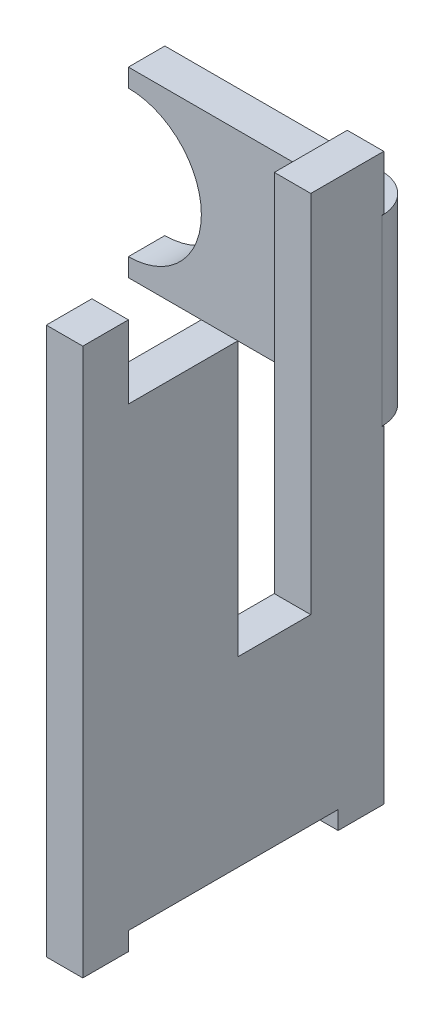
ISO-10303-21;
HEADER;
FILE_DESCRIPTION(('STEP AP214'),'2;1');
FILE_NAME('part.step','',(''),(''),'','','');
FILE_SCHEMA(('AUTOMOTIVE_DESIGN { 1 0 10303 214 1 1 1 1 }'));
ENDSEC;
DATA;
#1=APPLICATION_CONTEXT('core data for automotive mechanical design processes');
#2=APPLICATION_PROTOCOL_DEFINITION('international standard','automotive_design',2000,#1);
#3=PRODUCT_CONTEXT('',#1,'mechanical');
#4=PRODUCT('Part','Part','',(#3));
#5=PRODUCT_RELATED_PRODUCT_CATEGORY('part','',(#4));
#6=PRODUCT_DEFINITION_FORMATION('','',#4);
#7=PRODUCT_DEFINITION_CONTEXT('part definition',#1,'design');
#8=PRODUCT_DEFINITION('design','',#6,#7);
#9=PRODUCT_DEFINITION_SHAPE('','',#8);
#10=(LENGTH_UNIT() NAMED_UNIT(*) SI_UNIT(.MILLI.,.METRE.));
#11=(NAMED_UNIT(*) PLANE_ANGLE_UNIT() SI_UNIT($,.RADIAN.));
#12=(NAMED_UNIT(*) SI_UNIT($,.STERADIAN.) SOLID_ANGLE_UNIT());
#13=UNCERTAINTY_MEASURE_WITH_UNIT(LENGTH_MEASURE(1.E-05),#10,'distance_accuracy_value','');
#14=(GEOMETRIC_REPRESENTATION_CONTEXT(3) GLOBAL_UNCERTAINTY_ASSIGNED_CONTEXT((#13)) GLOBAL_UNIT_ASSIGNED_CONTEXT((#10,
#11,#12)) REPRESENTATION_CONTEXT('',''));
#15=CARTESIAN_POINT('',(0.,0.,0.));
#16=DIRECTION('',(0.,0.,1.));
#17=DIRECTION('',(1.,0.,0.));
#18=AXIS2_PLACEMENT_3D('',#15,#16,#17);
#19=CARTESIAN_POINT('',(-1.4,0.25,-1.025));
#20=DIRECTION('',(1.,0.,0.));
#21=DIRECTION('',(0.,0.,-1.));
#22=AXIS2_PLACEMENT_3D('',#19,#20,#21);
#23=PLANE('',#22);
#24=DIRECTION('',(0.,1.,0.));
#25=VECTOR('',#24,1.);
#26=CARTESIAN_POINT('',(-1.4,0.,-0.825));
#27=LINE('',#26,#25);
#28=CARTESIAN_POINT('',(-1.4,1.15,-0.825));
#29=VERTEX_POINT('',#28);
#30=CARTESIAN_POINT('',(-1.4,1.25,-0.825));
#31=VERTEX_POINT('',#30);
#32=EDGE_CURVE('E252',#29,#31,#27,.T.);
#33=ORIENTED_EDGE('',*,*,#32,.T.);
#34=DIRECTION('',(0.,0.,-1.));
#35=VECTOR('',#34,1.);
#36=CARTESIAN_POINT('',(-1.4,1.25,-1.025));
#37=LINE('',#36,#35);
#38=CARTESIAN_POINT('',(-1.4,1.25,-1.025));
#39=VERTEX_POINT('',#38);
#40=EDGE_CURVE('E204',#31,#39,#37,.T.);
#41=ORIENTED_EDGE('',*,*,#40,.T.);
#42=DIRECTION('',(0.,1.,0.));
#43=VECTOR('',#42,1.);
#44=CARTESIAN_POINT('',(-1.4,0.,-1.025));
#45=LINE('',#44,#43);
#46=CARTESIAN_POINT('',(-1.4,1.15,-1.025));
#47=VERTEX_POINT('',#46);
#48=EDGE_CURVE('E202',#47,#39,#45,.T.);
#49=ORIENTED_EDGE('',*,*,#48,.F.);
#50=DIRECTION('',(0.,0.,-1.));
#51=VECTOR('',#50,1.);
#52=CARTESIAN_POINT('',(-1.4,1.15,-4.69701497931));
#53=LINE('',#52,#51);
#54=EDGE_CURVE('E191',#47,#29,#53,.F.);
#55=ORIENTED_EDGE('',*,*,#54,.T.);
#56=EDGE_LOOP('',(#33,#41,#49,#55));
#57=FACE_BOUND('',#56,.T.);
#58=ADVANCED_FACE('F17',(#57),#23,.F.);
#59=CARTESIAN_POINT('',(-1.4,0.75,-4.69701497931));
#60=DIRECTION('',(0.,0.,-1.));
#61=DIRECTION('',(-1.,0.,0.));
#62=AXIS2_PLACEMENT_3D('',#59,#60,#61);
#63=CYLINDRICAL_SURFACE('',#62,0.4);
#64=ORIENTED_EDGE('',*,*,#54,.F.);
#65=CARTESIAN_POINT('',(-1.4,0.75,-1.025));
#66=DIRECTION('',(0.,0.,-1.));
#67=DIRECTION('',(-1.,0.,0.));
#68=AXIS2_PLACEMENT_3D('',#65,#66,#67);
#69=CIRCLE('',#68,0.4);
#70=CARTESIAN_POINT('',(-1.4,0.35,-1.025));
#71=VERTEX_POINT('',#70);
#72=EDGE_CURVE('E20',#71,#47,#69,.F.);
#73=ORIENTED_EDGE('',*,*,#72,.F.);
#74=DIRECTION('',(0.,0.,-1.));
#75=VECTOR('',#74,1.);
#76=CARTESIAN_POINT('',(-1.4,0.35,-1.025));
#77=LINE('',#76,#75);
#78=CARTESIAN_POINT('',(-1.4,0.35,-0.825));
#79=VERTEX_POINT('',#78);
#80=EDGE_CURVE('E186',#71,#79,#77,.F.);
#81=ORIENTED_EDGE('',*,*,#80,.T.);
#82=CARTESIAN_POINT('',(-1.4,0.75,-0.825));
#83=DIRECTION('',(0.,0.,-1.));
#84=DIRECTION('',(-1.,0.,0.));
#85=AXIS2_PLACEMENT_3D('',#82,#83,#84);
#86=CIRCLE('',#85,0.4);
#87=EDGE_CURVE('E197',#79,#29,#86,.F.);
#88=ORIENTED_EDGE('',*,*,#87,.T.);
#89=EDGE_LOOP('',(#64,#73,#81,#88));
#90=FACE_BOUND('',#89,.T.);
#91=ADVANCED_FACE('F193',(#90),#63,.F.);
#92=CARTESIAN_POINT('',(-1.4,0.25,-1.025));
#93=DIRECTION('',(1.,0.,0.));
#94=DIRECTION('',(0.,0.,-1.));
#95=AXIS2_PLACEMENT_3D('',#92,#93,#94);
#96=PLANE('',#95);
#97=DIRECTION('',(0.,1.,0.));
#98=VECTOR('',#97,1.);
#99=CARTESIAN_POINT('',(-1.4,0.,-1.025));
#100=LINE('',#99,#98);
#101=CARTESIAN_POINT('',(-1.4,0.25,-1.025));
#102=VERTEX_POINT('',#101);
#103=EDGE_CURVE('E211',#102,#71,#100,.T.);
#104=ORIENTED_EDGE('',*,*,#103,.F.);
#105=DIRECTION('',(0.,0.,1.));
#106=VECTOR('',#105,1.);
#107=CARTESIAN_POINT('',(-1.4,0.25,-1.025));
#108=LINE('',#107,#106);
#109=CARTESIAN_POINT('',(-1.4,0.25,-0.825));
#110=VERTEX_POINT('',#109);
#111=EDGE_CURVE('E219',#102,#110,#108,.T.);
#112=ORIENTED_EDGE('',*,*,#111,.T.);
#113=DIRECTION('',(0.,1.,0.));
#114=VECTOR('',#113,1.);
#115=CARTESIAN_POINT('',(-1.4,0.,-0.825));
#116=LINE('',#115,#114);
#117=EDGE_CURVE('E250',#110,#79,#116,.T.);
#118=ORIENTED_EDGE('',*,*,#117,.T.);
#119=ORIENTED_EDGE('',*,*,#80,.F.);
#120=EDGE_LOOP('',(#104,#112,#118,#119));
#121=FACE_BOUND('',#120,.T.);
#122=ADVANCED_FACE('F465',(#121),#96,.F.);
#123=CARTESIAN_POINT('',(0.,0.,-1.025));
#124=DIRECTION('',(0.,0.,-1.));
#125=DIRECTION('',(-1.,0.,0.));
#126=AXIS2_PLACEMENT_3D('',#123,#124,#125);
#127=PLANE('',#126);
#128=DIRECTION('',(0.,-1.,0.));
#129=VECTOR('',#128,1.);
#130=CARTESIAN_POINT('',(-0.21,0.25,-1.025));
#131=LINE('',#130,#129);
#132=CARTESIAN_POINT('',(-0.21,0.25,-1.025));
#133=VERTEX_POINT('',#132);
#134=CARTESIAN_POINT('',(-0.21,1.25,-1.025));
#135=VERTEX_POINT('',#134);
#136=EDGE_CURVE('E207',#133,#135,#131,.F.);
#137=ORIENTED_EDGE('',*,*,#136,.F.);
#138=DIRECTION('',(1.,0.,0.));
#139=VECTOR('',#138,1.);
#140=CARTESIAN_POINT('',(-0.150309739582,0.25,-1.025));
#141=LINE('',#140,#139);
#142=EDGE_CURVE('E249',#133,#102,#141,.F.);
#143=ORIENTED_EDGE('',*,*,#142,.T.);
#144=ORIENTED_EDGE('',*,*,#103,.T.);
#145=ORIENTED_EDGE('',*,*,#72,.T.);
#146=ORIENTED_EDGE('',*,*,#48,.T.);
#147=DIRECTION('',(1.,0.,0.));
#148=VECTOR('',#147,1.);
#149=CARTESIAN_POINT('',(-0.150309739582,1.25,-1.025));
#150=LINE('',#149,#148);
#151=EDGE_CURVE('E227',#39,#135,#150,.T.);
#152=ORIENTED_EDGE('',*,*,#151,.T.);
#153=EDGE_LOOP('',(#137,#143,#144,#145,#146,#152));
#154=FACE_BOUND('',#153,.T.);
#155=ADVANCED_FACE('F209',(#154),#127,.T.);
#156=CARTESIAN_POINT('',(-0.21,0.25,-0.815));
#157=DIRECTION('',(0.,-1.,0.));
#158=DIRECTION('',(0.,0.,-1.));
#159=AXIS2_PLACEMENT_3D('',#156,#157,#158);
#160=CYLINDRICAL_SURFACE('',#159,0.21);
#161=CARTESIAN_POINT('',(-0.21,0.25,-0.815));
#162=DIRECTION('',(0.,-1.,0.));
#163=DIRECTION('',(0.,0.,-1.));
#164=AXIS2_PLACEMENT_3D('',#161,#162,#163);
#165=CIRCLE('',#164,0.21);
#166=CARTESIAN_POINT('',(0.,0.25,-0.815));
#167=VERTEX_POINT('',#166);
#168=EDGE_CURVE('E246',#167,#133,#165,.F.);
#169=ORIENTED_EDGE('',*,*,#168,.T.);
#170=ORIENTED_EDGE('',*,*,#136,.T.);
#171=CARTESIAN_POINT('',(-0.21,1.25,-0.815));
#172=DIRECTION('',(0.,-1.,0.));
#173=DIRECTION('',(0.,0.,-1.));
#174=AXIS2_PLACEMENT_3D('',#171,#172,#173);
#175=CIRCLE('',#174,0.21);
#176=CARTESIAN_POINT('',(0.,1.25,-0.815));
#177=VERTEX_POINT('',#176);
#178=EDGE_CURVE('E251',#135,#177,#175,.T.);
#179=ORIENTED_EDGE('',*,*,#178,.T.);
#180=DIRECTION('',(0.,1.,0.));
#181=VECTOR('',#180,1.);
#182=CARTESIAN_POINT('',(0.,0.,-0.815));
#183=LINE('',#182,#181);
#184=EDGE_CURVE('E284',#177,#167,#183,.F.);
#185=ORIENTED_EDGE('',*,*,#184,.T.);
#186=EDGE_LOOP('',(#169,#170,#179,#185));
#187=FACE_BOUND('',#186,.T.);
#188=ADVANCED_FACE('F557',(#187),#160,.T.);
#189=CARTESIAN_POINT('',(-0.150309739582,1.25,-1.025));
#190=DIRECTION('',(0.,-1.,0.));
#191=DIRECTION('',(0.,0.,-1.));
#192=AXIS2_PLACEMENT_3D('',#189,#190,#191);
#193=PLANE('',#192);
#194=CARTESIAN_POINT('',(-0.21,1.25,-0.815));
#195=DIRECTION('',(0.,-1.,0.));
#196=DIRECTION('',(0.,0.,-1.));
#197=AXIS2_PLACEMENT_3D('',#194,#195,#196);
#198=CIRCLE('',#197,0.01);
#199=CARTESIAN_POINT('',(-0.21,1.25,-0.825));
#200=VERTEX_POINT('',#199);
#201=CARTESIAN_POINT('',(-0.2,1.25,-0.815));
#202=VERTEX_POINT('',#201);
#203=EDGE_CURVE('E243',#200,#202,#198,.T.);
#204=ORIENTED_EDGE('',*,*,#203,.T.);
#205=DIRECTION('',(1.,0.,0.));
#206=VECTOR('',#205,1.);
#207=CARTESIAN_POINT('',(0.,1.25,-0.815));
#208=LINE('',#207,#206);
#209=EDGE_CURVE('E245',#202,#177,#208,.T.);
#210=ORIENTED_EDGE('',*,*,#209,.T.);
#211=ORIENTED_EDGE('',*,*,#178,.F.);
#212=ORIENTED_EDGE('',*,*,#151,.F.);
#213=ORIENTED_EDGE('',*,*,#40,.F.);
#214=DIRECTION('',(-1.,0.,0.));
#215=VECTOR('',#214,1.);
#216=CARTESIAN_POINT('',(0.,1.25,-0.825));
#217=LINE('',#216,#215);
#218=EDGE_CURVE('E256',#31,#200,#217,.F.);
#219=ORIENTED_EDGE('',*,*,#218,.T.);
#220=EDGE_LOOP('',(#204,#210,#211,#212,#213,#219));
#221=FACE_BOUND('',#220,.T.);
#222=ADVANCED_FACE('F473',(#221),#193,.F.);
#223=CARTESIAN_POINT('',(0.,0.,-0.825));
#224=DIRECTION('',(0.,0.,-1.));
#225=DIRECTION('',(-1.,0.,0.));
#226=AXIS2_PLACEMENT_3D('',#223,#224,#225);
#227=PLANE('',#226);
#228=ORIENTED_EDGE('',*,*,#117,.F.);
#229=DIRECTION('',(1.,0.,0.));
#230=VECTOR('',#229,1.);
#231=CARTESIAN_POINT('',(-0.150309739582,0.25,-0.825));
#232=LINE('',#231,#230);
#233=CARTESIAN_POINT('',(-0.21,0.25,-0.825));
#234=VERTEX_POINT('',#233);
#235=EDGE_CURVE('E221',#110,#234,#232,.T.);
#236=ORIENTED_EDGE('',*,*,#235,.T.);
#237=DIRECTION('',(0.,-1.,0.));
#238=VECTOR('',#237,1.);
#239=CARTESIAN_POINT('',(-0.21,0.25,-0.825));
#240=LINE('',#239,#238);
#241=EDGE_CURVE('E239',#234,#200,#240,.F.);
#242=ORIENTED_EDGE('',*,*,#241,.T.);
#243=ORIENTED_EDGE('',*,*,#218,.F.);
#244=ORIENTED_EDGE('',*,*,#32,.F.);
#245=ORIENTED_EDGE('',*,*,#87,.F.);
#246=EDGE_LOOP('',(#228,#236,#242,#243,#244,#245));
#247=FACE_BOUND('',#246,.T.);
#248=ADVANCED_FACE('F469',(#247),#227,.F.);
#249=CARTESIAN_POINT('',(-0.150309739582,0.25,-1.025));
#250=DIRECTION('',(0.,1.,0.));
#251=DIRECTION('',(0.,0.,1.));
#252=AXIS2_PLACEMENT_3D('',#249,#250,#251);
#253=PLANE('',#252);
#254=ORIENTED_EDGE('',*,*,#168,.F.);
#255=DIRECTION('',(1.,0.,0.));
#256=VECTOR('',#255,1.);
#257=CARTESIAN_POINT('',(0.,0.25,-0.815));
#258=LINE('',#257,#256);
#259=CARTESIAN_POINT('',(-0.2,0.25,-0.815));
#260=VERTEX_POINT('',#259);
#261=EDGE_CURVE('E238',#167,#260,#258,.F.);
#262=ORIENTED_EDGE('',*,*,#261,.T.);
#263=CARTESIAN_POINT('',(-0.21,0.25,-0.815));
#264=DIRECTION('',(0.,-1.,0.));
#265=DIRECTION('',(0.,0.,-1.));
#266=AXIS2_PLACEMENT_3D('',#263,#264,#265);
#267=CIRCLE('',#266,0.01);
#268=EDGE_CURVE('E240',#260,#234,#267,.F.);
#269=ORIENTED_EDGE('',*,*,#268,.T.);
#270=ORIENTED_EDGE('',*,*,#235,.F.);
#271=ORIENTED_EDGE('',*,*,#111,.F.);
#272=ORIENTED_EDGE('',*,*,#142,.F.);
#273=EDGE_LOOP('',(#254,#262,#269,#270,#271,#272));
#274=FACE_BOUND('',#273,.T.);
#275=ADVANCED_FACE('F556',(#274),#253,.F.);
#276=CARTESIAN_POINT('',(0.,0.,0.));
#277=DIRECTION('',(-1.,0.,0.));
#278=DIRECTION('',(0.,0.,1.));
#279=AXIS2_PLACEMENT_3D('',#276,#277,#278);
#280=PLANE('',#279);
#281=DIRECTION('',(0.,0.,1.));
#282=VECTOR('',#281,1.);
#283=CARTESIAN_POINT('',(0.,1.252,-0.825));
#284=LINE('',#283,#282);
#285=CARTESIAN_POINT('',(0.,1.252,-0.815));
#286=VERTEX_POINT('',#285);
#287=CARTESIAN_POINT('',(0.,1.252,-0.825));
#288=VERTEX_POINT('',#287);
#289=EDGE_CURVE('E270',#286,#288,#284,.F.);
#290=ORIENTED_EDGE('',*,*,#289,.T.);
#291=DIRECTION('',(0.,1.,0.));
#292=VECTOR('',#291,1.);
#293=CARTESIAN_POINT('',(0.,0.,-0.825));
#294=LINE('',#293,#292);
#295=CARTESIAN_POINT('',(0.,1.55,-0.825));
#296=VERTEX_POINT('',#295);
#297=EDGE_CURVE('E273',#296,#288,#294,.F.);
#298=ORIENTED_EDGE('',*,*,#297,.F.);
#299=DIRECTION('',(0.,0.,1.));
#300=VECTOR('',#299,1.);
#301=CARTESIAN_POINT('',(0.,1.55,0.));
#302=LINE('',#301,#300);
#303=CARTESIAN_POINT('',(0.,1.55,-0.425));
#304=VERTEX_POINT('',#303);
#305=EDGE_CURVE('E275',#304,#296,#302,.F.);
#306=ORIENTED_EDGE('',*,*,#305,.F.);
#307=DIRECTION('',(0.,1.,0.));
#308=VECTOR('',#307,1.);
#309=CARTESIAN_POINT('',(0.,-0.45,-0.425));
#310=LINE('',#309,#308);
#311=CARTESIAN_POINT('',(0.,-0.45,-0.425));
#312=VERTEX_POINT('',#311);
#313=EDGE_CURVE('E287',#304,#312,#310,.F.);
#314=ORIENTED_EDGE('',*,*,#313,.T.);
#315=DIRECTION('',(0.,0.,-1.));
#316=VECTOR('',#315,1.);
#317=CARTESIAN_POINT('',(0.,-0.45,-0.025));
#318=LINE('',#317,#316);
#319=CARTESIAN_POINT('',(0.,-0.45,-0.0250000000000001));
#320=VERTEX_POINT('',#319);
#321=EDGE_CURVE('E353',#312,#320,#318,.F.);
#322=ORIENTED_EDGE('',*,*,#321,.T.);
#323=DIRECTION('',(0.,-1.,0.));
#324=VECTOR('',#323,1.);
#325=CARTESIAN_POINT('',(0.,1.05,-0.025));
#326=LINE('',#325,#324);
#327=CARTESIAN_POINT('',(0.,1.05,-0.025));
#328=VERTEX_POINT('',#327);
#329=EDGE_CURVE('E358',#320,#328,#326,.F.);
#330=ORIENTED_EDGE('',*,*,#329,.T.);
#331=DIRECTION('',(0.,0.,-1.));
#332=VECTOR('',#331,1.);
#333=CARTESIAN_POINT('',(0.,1.05,0.575));
#334=LINE('',#333,#332);
#335=CARTESIAN_POINT('',(0.,1.05,0.575));
#336=VERTEX_POINT('',#335);
#337=EDGE_CURVE('E363',#328,#336,#334,.F.);
#338=ORIENTED_EDGE('',*,*,#337,.T.);
#339=DIRECTION('',(0.,1.,0.));
#340=VECTOR('',#339,1.);
#341=CARTESIAN_POINT('',(0.,1.45,0.575));
#342=LINE('',#341,#340);
#343=CARTESIAN_POINT('',(0.,1.45,0.575));
#344=VERTEX_POINT('',#343);
#345=EDGE_CURVE('E368',#336,#344,#342,.T.);
#346=ORIENTED_EDGE('',*,*,#345,.T.);
#347=DIRECTION('',(0.,0.,-1.));
#348=VECTOR('',#347,1.);
#349=CARTESIAN_POINT('',(0.,1.45,0.825));
#350=LINE('',#349,#348);
#351=CARTESIAN_POINT('',(0.,1.45,0.825));
#352=VERTEX_POINT('',#351);
#353=EDGE_CURVE('E373',#344,#352,#350,.F.);
#354=ORIENTED_EDGE('',*,*,#353,.T.);
#355=DIRECTION('',(0.,1.,0.));
#356=VECTOR('',#355,1.);
#357=CARTESIAN_POINT('',(0.,-1.55,0.825));
#358=LINE('',#357,#356);
#359=CARTESIAN_POINT('',(0.,-1.55,0.825));
#360=VERTEX_POINT('',#359);
#361=EDGE_CURVE('E378',#352,#360,#358,.F.);
#362=ORIENTED_EDGE('',*,*,#361,.T.);
#363=DIRECTION('',(0.,0.,1.));
#364=VECTOR('',#363,1.);
#365=CARTESIAN_POINT('',(0.,-1.55,-0.825));
#366=LINE('',#365,#364);
#367=CARTESIAN_POINT('',(0.,-1.55,0.575));
#368=VERTEX_POINT('',#367);
#369=EDGE_CURVE('E385',#360,#368,#366,.F.);
#370=ORIENTED_EDGE('',*,*,#369,.T.);
#371=DIRECTION('',(0.,1.,0.));
#372=VECTOR('',#371,1.);
#373=CARTESIAN_POINT('',(0.,-1.55,0.575));
#374=LINE('',#373,#372);
#375=CARTESIAN_POINT('',(0.,-1.45,0.575));
#376=VERTEX_POINT('',#375);
#377=EDGE_CURVE('E387',#376,#368,#374,.F.);
#378=ORIENTED_EDGE('',*,*,#377,.F.);
#379=DIRECTION('',(0.,0.,-1.));
#380=VECTOR('',#379,1.);
#381=CARTESIAN_POINT('',(0.,-1.45,0.575));
#382=LINE('',#381,#380);
#383=CARTESIAN_POINT('',(0.,-1.45,-0.575));
#384=VERTEX_POINT('',#383);
#385=EDGE_CURVE('E393',#384,#376,#382,.F.);
#386=ORIENTED_EDGE('',*,*,#385,.F.);
#387=DIRECTION('',(0.,1.,0.));
#388=VECTOR('',#387,1.);
#389=CARTESIAN_POINT('',(0.,-1.45,-0.575));
#390=LINE('',#389,#388);
#391=CARTESIAN_POINT('',(0.,-1.55,-0.575));
#392=VERTEX_POINT('',#391);
#393=EDGE_CURVE('E398',#392,#384,#390,.T.);
#394=ORIENTED_EDGE('',*,*,#393,.F.);
#395=DIRECTION('',(0.,0.,1.));
#396=VECTOR('',#395,1.);
#397=CARTESIAN_POINT('',(0.,-1.55,-0.825));
#398=LINE('',#397,#396);
#399=CARTESIAN_POINT('',(0.,-1.55,-0.825));
#400=VERTEX_POINT('',#399);
#401=EDGE_CURVE('E414',#392,#400,#398,.F.);
#402=ORIENTED_EDGE('',*,*,#401,.T.);
#403=DIRECTION('',(0.,1.,0.));
#404=VECTOR('',#403,1.);
#405=CARTESIAN_POINT('',(0.,1.55,-0.825));
#406=LINE('',#405,#404);
#407=CARTESIAN_POINT('',(0.,0.248,-0.825));
#408=VERTEX_POINT('',#407);
#409=EDGE_CURVE('E406',#400,#408,#406,.T.);
#410=ORIENTED_EDGE('',*,*,#409,.T.);
#411=DIRECTION('',(0.,0.,-1.));
#412=VECTOR('',#411,1.);
#413=CARTESIAN_POINT('',(0.,0.248,-0.825));
#414=LINE('',#413,#412);
#415=CARTESIAN_POINT('',(0.,0.248,-0.815));
#416=VERTEX_POINT('',#415);
#417=EDGE_CURVE('E407',#408,#416,#414,.F.);
#418=ORIENTED_EDGE('',*,*,#417,.T.);
#419=DIRECTION('',(0.,1.,0.));
#420=VECTOR('',#419,1.);
#421=CARTESIAN_POINT('',(0.,0.,-0.815));
#422=LINE('',#421,#420);
#423=EDGE_CURVE('E235',#416,#167,#422,.T.);
#424=ORIENTED_EDGE('',*,*,#423,.T.);
#425=ORIENTED_EDGE('',*,*,#184,.F.);
#426=DIRECTION('',(0.,1.,0.));
#427=VECTOR('',#426,1.);
#428=CARTESIAN_POINT('',(0.,0.248,-0.815));
#429=LINE('',#428,#427);
#430=EDGE_CURVE('E267',#177,#286,#429,.T.);
#431=ORIENTED_EDGE('',*,*,#430,.T.);
#432=EDGE_LOOP('',(#290,#298,#306,#314,#322,#330,#338,#346,#354,#362,#370,#378,#386,#394,#402,
#410,#418,#424,#425,#431));
#433=FACE_BOUND('',#432,.T.);
#434=ADVANCED_FACE('F484',(#433),#280,.F.);
#435=CARTESIAN_POINT('',(0.,1.252,-0.825));
#436=DIRECTION('',(0.,1.,0.));
#437=DIRECTION('',(0.,0.,1.));
#438=AXIS2_PLACEMENT_3D('',#435,#436,#437);
#439=PLANE('',#438);
#440=ORIENTED_EDGE('',*,*,#289,.F.);
#441=DIRECTION('',(1.,0.,0.));
#442=VECTOR('',#441,1.);
#443=CARTESIAN_POINT('',(0.,1.252,-0.815));
#444=LINE('',#443,#442);
#445=CARTESIAN_POINT('',(-0.2,1.252,-0.815));
#446=VERTEX_POINT('',#445);
#447=EDGE_CURVE('E269',#286,#446,#444,.F.);
#448=ORIENTED_EDGE('',*,*,#447,.T.);
#449=DIRECTION('',(0.,0.,1.));
#450=VECTOR('',#449,1.);
#451=CARTESIAN_POINT('',(-0.2,1.252,0.));
#452=LINE('',#451,#450);
#453=CARTESIAN_POINT('',(-0.2,1.252,-0.825));
#454=VERTEX_POINT('',#453);
#455=EDGE_CURVE('E420',#454,#446,#452,.T.);
#456=ORIENTED_EDGE('',*,*,#455,.F.);
#457=DIRECTION('',(1.,0.,0.));
#458=VECTOR('',#457,1.);
#459=CARTESIAN_POINT('',(-0.2,1.252,-0.825));
#460=LINE('',#459,#458);
#461=EDGE_CURVE('E279',#454,#288,#460,.T.);
#462=ORIENTED_EDGE('',*,*,#461,.T.);
#463=EDGE_LOOP('',(#440,#448,#456,#462));
#464=FACE_BOUND('',#463,.T.);
#465=ADVANCED_FACE('F487',(#464),#439,.F.);
#466=CARTESIAN_POINT('',(0.,0.248,-0.815));
#467=DIRECTION('',(0.,0.,1.));
#468=DIRECTION('',(1.,0.,0.));
#469=AXIS2_PLACEMENT_3D('',#466,#467,#468);
#470=PLANE('',#469);
#471=DIRECTION('',(0.,1.,0.));
#472=VECTOR('',#471,1.);
#473=CARTESIAN_POINT('',(-0.2,0.,-0.815));
#474=LINE('',#473,#472);
#475=EDGE_CURVE('E351',#446,#202,#474,.F.);
#476=ORIENTED_EDGE('',*,*,#475,.F.);
#477=ORIENTED_EDGE('',*,*,#447,.F.);
#478=ORIENTED_EDGE('',*,*,#430,.F.);
#479=ORIENTED_EDGE('',*,*,#209,.F.);
#480=EDGE_LOOP('',(#476,#477,#478,#479));
#481=FACE_BOUND('',#480,.T.);
#482=ADVANCED_FACE('F481',(#481),#470,.F.);
#483=CARTESIAN_POINT('',(-0.21,0.25,-0.815));
#484=DIRECTION('',(0.,-1.,0.));
#485=DIRECTION('',(0.,0.,-1.));
#486=AXIS2_PLACEMENT_3D('',#483,#484,#485);
#487=CYLINDRICAL_SURFACE('',#486,0.01);
#488=ORIENTED_EDGE('',*,*,#268,.F.);
#489=DIRECTION('',(0.,1.,0.));
#490=VECTOR('',#489,1.);
#491=CARTESIAN_POINT('',(-0.2,0.,-0.815));
#492=LINE('',#491,#490);
#493=EDGE_CURVE('E234',#202,#260,#492,.F.);
#494=ORIENTED_EDGE('',*,*,#493,.F.);
#495=ORIENTED_EDGE('',*,*,#203,.F.);
#496=ORIENTED_EDGE('',*,*,#241,.F.);
#497=EDGE_LOOP('',(#488,#494,#495,#496));
#498=FACE_BOUND('',#497,.T.);
#499=ADVANCED_FACE('F494',(#498),#487,.F.);
#500=CARTESIAN_POINT('',(0.,0.248,-0.815));
#501=DIRECTION('',(0.,0.,1.));
#502=DIRECTION('',(1.,0.,0.));
#503=AXIS2_PLACEMENT_3D('',#500,#501,#502);
#504=PLANE('',#503);
#505=ORIENTED_EDGE('',*,*,#423,.F.);
#506=DIRECTION('',(1.,0.,0.));
#507=VECTOR('',#506,1.);
#508=CARTESIAN_POINT('',(0.,0.248,-0.815));
#509=LINE('',#508,#507);
#510=CARTESIAN_POINT('',(-0.2,0.248,-0.815));
#511=VERTEX_POINT('',#510);
#512=EDGE_CURVE('E404',#416,#511,#509,.F.);
#513=ORIENTED_EDGE('',*,*,#512,.T.);
#514=DIRECTION('',(0.,1.,0.));
#515=VECTOR('',#514,1.);
#516=CARTESIAN_POINT('',(-0.2,0.,-0.815));
#517=LINE('',#516,#515);
#518=EDGE_CURVE('E230',#260,#511,#517,.F.);
#519=ORIENTED_EDGE('',*,*,#518,.F.);
#520=ORIENTED_EDGE('',*,*,#261,.F.);
#521=EDGE_LOOP('',(#505,#513,#519,#520));
#522=FACE_BOUND('',#521,.T.);
#523=ADVANCED_FACE('F500',(#522),#504,.F.);
#524=CARTESIAN_POINT('',(0.,0.248,-0.825));
#525=DIRECTION('',(0.,-1.,0.));
#526=DIRECTION('',(0.,0.,-1.));
#527=AXIS2_PLACEMENT_3D('',#524,#525,#526);
#528=PLANE('',#527);
#529=ORIENTED_EDGE('',*,*,#417,.F.);
#530=DIRECTION('',(1.,0.,0.));
#531=VECTOR('',#530,1.);
#532=CARTESIAN_POINT('',(-0.2,0.248,-0.825));
#533=LINE('',#532,#531);
#534=CARTESIAN_POINT('',(-0.2,0.248,-0.825));
#535=VERTEX_POINT('',#534);
#536=EDGE_CURVE('E412',#408,#535,#533,.F.);
#537=ORIENTED_EDGE('',*,*,#536,.T.);
#538=DIRECTION('',(0.,0.,1.));
#539=VECTOR('',#538,1.);
#540=CARTESIAN_POINT('',(-0.2,0.248,0.));
#541=LINE('',#540,#539);
#542=EDGE_CURVE('E233',#511,#535,#541,.F.);
#543=ORIENTED_EDGE('',*,*,#542,.F.);
#544=ORIENTED_EDGE('',*,*,#512,.F.);
#545=EDGE_LOOP('',(#529,#537,#543,#544));
#546=FACE_BOUND('',#545,.T.);
#547=ADVANCED_FACE('F505',(#546),#528,.F.);
#548=CARTESIAN_POINT('',(-0.2,1.55,-0.825));
#549=DIRECTION('',(0.,0.,1.));
#550=DIRECTION('',(1.,0.,0.));
#551=AXIS2_PLACEMENT_3D('',#548,#549,#550);
#552=PLANE('',#551);
#553=ORIENTED_EDGE('',*,*,#536,.F.);
#554=ORIENTED_EDGE('',*,*,#409,.F.);
#555=DIRECTION('',(1.,0.,0.));
#556=VECTOR('',#555,1.);
#557=CARTESIAN_POINT('',(-0.2,-1.55,-0.825));
#558=LINE('',#557,#556);
#559=CARTESIAN_POINT('',(-0.2,-1.55,-0.825));
#560=VERTEX_POINT('',#559);
#561=EDGE_CURVE('E403',#400,#560,#558,.F.);
#562=ORIENTED_EDGE('',*,*,#561,.T.);
#563=DIRECTION('',(0.,1.,0.));
#564=VECTOR('',#563,1.);
#565=CARTESIAN_POINT('',(-0.2,0.,-0.825));
#566=LINE('',#565,#564);
#567=EDGE_CURVE('E344',#535,#560,#566,.F.);
#568=ORIENTED_EDGE('',*,*,#567,.F.);
#569=EDGE_LOOP('',(#553,#554,#562,#568));
#570=FACE_BOUND('',#569,.T.);
#571=ADVANCED_FACE('F510',(#570),#552,.F.);
#572=CARTESIAN_POINT('',(-0.2,-1.55,-0.825));
#573=DIRECTION('',(0.,1.,0.));
#574=DIRECTION('',(0.,0.,1.));
#575=AXIS2_PLACEMENT_3D('',#572,#573,#574);
#576=PLANE('',#575);
#577=DIRECTION('',(0.,0.,1.));
#578=VECTOR('',#577,1.);
#579=CARTESIAN_POINT('',(-0.2,-1.55,0.));
#580=LINE('',#579,#578);
#581=CARTESIAN_POINT('',(-0.2,-1.55,-0.575));
#582=VERTEX_POINT('',#581);
#583=EDGE_CURVE('E341',#560,#582,#580,.T.);
#584=ORIENTED_EDGE('',*,*,#583,.F.);
#585=ORIENTED_EDGE('',*,*,#561,.F.);
#586=ORIENTED_EDGE('',*,*,#401,.F.);
#587=DIRECTION('',(1.,0.,0.));
#588=VECTOR('',#587,1.);
#589=CARTESIAN_POINT('',(-3.517456467392,-1.55,-0.575));
#590=LINE('',#589,#588);
#591=EDGE_CURVE('E400',#582,#392,#590,.T.);
#592=ORIENTED_EDGE('',*,*,#591,.F.);
#593=EDGE_LOOP('',(#584,#585,#586,#592));
#594=FACE_BOUND('',#593,.T.);
#595=ADVANCED_FACE('F514',(#594),#576,.F.);
#596=CARTESIAN_POINT('',(-3.517456467392,-1.45,-0.575));
#597=DIRECTION('',(0.,0.,1.));
#598=DIRECTION('',(1.,0.,0.));
#599=AXIS2_PLACEMENT_3D('',#596,#597,#598);
#600=PLANE('',#599);
#601=DIRECTION('',(1.,0.,0.));
#602=VECTOR('',#601,1.);
#603=CARTESIAN_POINT('',(-3.517456467392,-1.45,-0.575));
#604=LINE('',#603,#602);
#605=CARTESIAN_POINT('',(-0.2,-1.45,-0.575));
#606=VERTEX_POINT('',#605);
#607=EDGE_CURVE('E395',#606,#384,#604,.T.);
#608=ORIENTED_EDGE('',*,*,#607,.F.);
#609=DIRECTION('',(0.,1.,0.));
#610=VECTOR('',#609,1.);
#611=CARTESIAN_POINT('',(-0.2,0.,-0.575));
#612=LINE('',#611,#610);
#613=EDGE_CURVE('E338',#582,#606,#612,.T.);
#614=ORIENTED_EDGE('',*,*,#613,.F.);
#615=ORIENTED_EDGE('',*,*,#591,.T.);
#616=ORIENTED_EDGE('',*,*,#393,.T.);
#617=EDGE_LOOP('',(#608,#614,#615,#616));
#618=FACE_BOUND('',#617,.T.);
#619=ADVANCED_FACE('F518',(#618),#600,.T.);
#620=CARTESIAN_POINT('',(-3.517456467392,-1.45,0.575));
#621=DIRECTION('',(0.,-1.,0.));
#622=DIRECTION('',(0.,0.,-1.));
#623=AXIS2_PLACEMENT_3D('',#620,#621,#622);
#624=PLANE('',#623);
#625=DIRECTION('',(-1.,0.,0.));
#626=VECTOR('',#625,1.);
#627=CARTESIAN_POINT('',(-3.517456467392,-1.45,0.575));
#628=LINE('',#627,#626);
#629=CARTESIAN_POINT('',(-0.2,-1.45,0.575));
#630=VERTEX_POINT('',#629);
#631=EDGE_CURVE('E390',#630,#376,#628,.F.);
#632=ORIENTED_EDGE('',*,*,#631,.F.);
#633=DIRECTION('',(0.,0.,1.));
#634=VECTOR('',#633,1.);
#635=CARTESIAN_POINT('',(-0.2,-1.45,0.));
#636=LINE('',#635,#634);
#637=EDGE_CURVE('E335',#606,#630,#636,.T.);
#638=ORIENTED_EDGE('',*,*,#637,.F.);
#639=ORIENTED_EDGE('',*,*,#607,.T.);
#640=ORIENTED_EDGE('',*,*,#385,.T.);
#641=EDGE_LOOP('',(#632,#638,#639,#640));
#642=FACE_BOUND('',#641,.T.);
#643=ADVANCED_FACE('F522',(#642),#624,.T.);
#644=CARTESIAN_POINT('',(-3.517456467392,-1.55,0.575));
#645=DIRECTION('',(0.,0.,-1.));
#646=DIRECTION('',(-1.,0.,0.));
#647=AXIS2_PLACEMENT_3D('',#644,#645,#646);
#648=PLANE('',#647);
#649=DIRECTION('',(1.,0.,0.));
#650=VECTOR('',#649,1.);
#651=CARTESIAN_POINT('',(-0.2,-1.55,0.575));
#652=LINE('',#651,#650);
#653=CARTESIAN_POINT('',(-0.2,-1.55,0.575));
#654=VERTEX_POINT('',#653);
#655=EDGE_CURVE('E383',#368,#654,#652,.F.);
#656=ORIENTED_EDGE('',*,*,#655,.T.);
#657=DIRECTION('',(0.,1.,0.));
#658=VECTOR('',#657,1.);
#659=CARTESIAN_POINT('',(-0.2,0.,0.575));
#660=LINE('',#659,#658);
#661=EDGE_CURVE('E332',#630,#654,#660,.F.);
#662=ORIENTED_EDGE('',*,*,#661,.F.);
#663=ORIENTED_EDGE('',*,*,#631,.T.);
#664=ORIENTED_EDGE('',*,*,#377,.T.);
#665=EDGE_LOOP('',(#656,#662,#663,#664));
#666=FACE_BOUND('',#665,.T.);
#667=ADVANCED_FACE('F526',(#666),#648,.T.);
#668=CARTESIAN_POINT('',(-0.2,-1.55,-0.825));
#669=DIRECTION('',(0.,1.,0.));
#670=DIRECTION('',(0.,0.,1.));
#671=AXIS2_PLACEMENT_3D('',#668,#669,#670);
#672=PLANE('',#671);
#673=ORIENTED_EDGE('',*,*,#655,.F.);
#674=ORIENTED_EDGE('',*,*,#369,.F.);
#675=DIRECTION('',(1.,0.,0.));
#676=VECTOR('',#675,1.);
#677=CARTESIAN_POINT('',(-0.2,-1.55,0.825));
#678=LINE('',#677,#676);
#679=CARTESIAN_POINT('',(-0.2,-1.55,0.825));
#680=VERTEX_POINT('',#679);
#681=EDGE_CURVE('E381',#360,#680,#678,.F.);
#682=ORIENTED_EDGE('',*,*,#681,.T.);
#683=DIRECTION('',(0.,0.,1.));
#684=VECTOR('',#683,1.);
#685=CARTESIAN_POINT('',(-0.2,-1.55,0.));
#686=LINE('',#685,#684);
#687=EDGE_CURVE('E329',#654,#680,#686,.T.);
#688=ORIENTED_EDGE('',*,*,#687,.F.);
#689=EDGE_LOOP('',(#673,#674,#682,#688));
#690=FACE_BOUND('',#689,.T.);
#691=ADVANCED_FACE('F530',(#690),#672,.F.);
#692=CARTESIAN_POINT('',(-0.2,-1.55,0.825));
#693=DIRECTION('',(0.,0.,-1.));
#694=DIRECTION('',(0.,1.,0.));
#695=AXIS2_PLACEMENT_3D('',#692,#693,#694);
#696=PLANE('',#695);
#697=DIRECTION('',(1.,0.,0.));
#698=VECTOR('',#697,1.);
#699=CARTESIAN_POINT('',(-0.2,1.45,0.825));
#700=LINE('',#699,#698);
#701=CARTESIAN_POINT('',(-0.2,1.45,0.825));
#702=VERTEX_POINT('',#701);
#703=EDGE_CURVE('E376',#352,#702,#700,.F.);
#704=ORIENTED_EDGE('',*,*,#703,.T.);
#705=DIRECTION('',(0.,1.,0.));
#706=VECTOR('',#705,1.);
#707=CARTESIAN_POINT('',(-0.2,0.,0.825));
#708=LINE('',#707,#706);
#709=EDGE_CURVE('E326',#680,#702,#708,.T.);
#710=ORIENTED_EDGE('',*,*,#709,.F.);
#711=ORIENTED_EDGE('',*,*,#681,.F.);
#712=ORIENTED_EDGE('',*,*,#361,.F.);
#713=EDGE_LOOP('',(#704,#710,#711,#712));
#714=FACE_BOUND('',#713,.T.);
#715=ADVANCED_FACE('F535',(#714),#696,.F.);
#716=CARTESIAN_POINT('',(-0.2,1.45,0.825));
#717=DIRECTION('',(0.,-1.,0.));
#718=DIRECTION('',(0.,0.,-1.));
#719=AXIS2_PLACEMENT_3D('',#716,#717,#718);
#720=PLANE('',#719);
#721=DIRECTION('',(1.,0.,0.));
#722=VECTOR('',#721,1.);
#723=CARTESIAN_POINT('',(-0.2,1.45,0.575));
#724=LINE('',#723,#722);
#725=CARTESIAN_POINT('',(-0.2,1.45,0.575));
#726=VERTEX_POINT('',#725);
#727=EDGE_CURVE('E371',#344,#726,#724,.F.);
#728=ORIENTED_EDGE('',*,*,#727,.T.);
#729=DIRECTION('',(0.,0.,1.));
#730=VECTOR('',#729,1.);
#731=CARTESIAN_POINT('',(-0.2,1.45,0.));
#732=LINE('',#731,#730);
#733=EDGE_CURVE('E323',#702,#726,#732,.F.);
#734=ORIENTED_EDGE('',*,*,#733,.F.);
#735=ORIENTED_EDGE('',*,*,#703,.F.);
#736=ORIENTED_EDGE('',*,*,#353,.F.);
#737=EDGE_LOOP('',(#728,#734,#735,#736));
#738=FACE_BOUND('',#737,.T.);
#739=ADVANCED_FACE('F538',(#738),#720,.F.);
#740=CARTESIAN_POINT('',(-0.2,1.45,0.575));
#741=DIRECTION('',(0.,0.,1.));
#742=DIRECTION('',(1.,0.,0.));
#743=AXIS2_PLACEMENT_3D('',#740,#741,#742);
#744=PLANE('',#743);
#745=DIRECTION('',(1.,0.,0.));
#746=VECTOR('',#745,1.);
#747=CARTESIAN_POINT('',(-0.2,1.05,0.575));
#748=LINE('',#747,#746);
#749=CARTESIAN_POINT('',(-0.2,1.05,0.575));
#750=VERTEX_POINT('',#749);
#751=EDGE_CURVE('E366',#336,#750,#748,.F.);
#752=ORIENTED_EDGE('',*,*,#751,.T.);
#753=DIRECTION('',(0.,1.,0.));
#754=VECTOR('',#753,1.);
#755=CARTESIAN_POINT('',(-0.2,0.,0.575));
#756=LINE('',#755,#754);
#757=EDGE_CURVE('E320',#726,#750,#756,.F.);
#758=ORIENTED_EDGE('',*,*,#757,.F.);
#759=ORIENTED_EDGE('',*,*,#727,.F.);
#760=ORIENTED_EDGE('',*,*,#345,.F.);
#761=EDGE_LOOP('',(#752,#758,#759,#760));
#762=FACE_BOUND('',#761,.T.);
#763=ADVANCED_FACE('F542',(#762),#744,.F.);
#764=CARTESIAN_POINT('',(-0.2,1.05,0.575));
#765=DIRECTION('',(0.,-1.,0.));
#766=DIRECTION('',(0.,0.,-1.));
#767=AXIS2_PLACEMENT_3D('',#764,#765,#766);
#768=PLANE('',#767);
#769=DIRECTION('',(1.,0.,0.));
#770=VECTOR('',#769,1.);
#771=CARTESIAN_POINT('',(-0.2,1.05,-0.025));
#772=LINE('',#771,#770);
#773=CARTESIAN_POINT('',(-0.2,1.05,-0.025));
#774=VERTEX_POINT('',#773);
#775=EDGE_CURVE('E361',#328,#774,#772,.F.);
#776=ORIENTED_EDGE('',*,*,#775,.T.);
#777=DIRECTION('',(0.,0.,1.));
#778=VECTOR('',#777,1.);
#779=CARTESIAN_POINT('',(-0.2,1.05,0.));
#780=LINE('',#779,#778);
#781=EDGE_CURVE('E317',#750,#774,#780,.F.);
#782=ORIENTED_EDGE('',*,*,#781,.F.);
#783=ORIENTED_EDGE('',*,*,#751,.F.);
#784=ORIENTED_EDGE('',*,*,#337,.F.);
#785=EDGE_LOOP('',(#776,#782,#783,#784));
#786=FACE_BOUND('',#785,.T.);
#787=ADVANCED_FACE('F547',(#786),#768,.F.);
#788=CARTESIAN_POINT('',(-0.2,1.05,-0.025));
#789=DIRECTION('',(0.,0.,1.));
#790=DIRECTION('',(0.,-1.,0.));
#791=AXIS2_PLACEMENT_3D('',#788,#789,#790);
#792=PLANE('',#791);
#793=DIRECTION('',(1.,0.,0.));
#794=VECTOR('',#793,1.);
#795=CARTESIAN_POINT('',(-0.2,-0.45,-0.025));
#796=LINE('',#795,#794);
#797=CARTESIAN_POINT('',(-0.2,-0.45,-0.0250000000000001));
#798=VERTEX_POINT('',#797);
#799=EDGE_CURVE('E356',#320,#798,#796,.F.);
#800=ORIENTED_EDGE('',*,*,#799,.T.);
#801=DIRECTION('',(0.,1.,0.));
#802=VECTOR('',#801,1.);
#803=CARTESIAN_POINT('',(-0.2,0.,-0.025));
#804=LINE('',#803,#802);
#805=EDGE_CURVE('E313',#774,#798,#804,.F.);
#806=ORIENTED_EDGE('',*,*,#805,.F.);
#807=ORIENTED_EDGE('',*,*,#775,.F.);
#808=ORIENTED_EDGE('',*,*,#329,.F.);
#809=EDGE_LOOP('',(#800,#806,#807,#808));
#810=FACE_BOUND('',#809,.T.);
#811=ADVANCED_FACE('F550',(#810),#792,.F.);
#812=CARTESIAN_POINT('',(-0.2,-0.45,-0.025));
#813=DIRECTION('',(0.,-1.,0.));
#814=DIRECTION('',(0.,0.,-1.));
#815=AXIS2_PLACEMENT_3D('',#812,#813,#814);
#816=PLANE('',#815);
#817=DIRECTION('',(1.,0.,0.));
#818=VECTOR('',#817,1.);
#819=CARTESIAN_POINT('',(-0.2,-0.45,-0.425));
#820=LINE('',#819,#818);
#821=CARTESIAN_POINT('',(-0.2,-0.45,-0.425));
#822=VERTEX_POINT('',#821);
#823=EDGE_CURVE('E290',#312,#822,#820,.F.);
#824=ORIENTED_EDGE('',*,*,#823,.T.);
#825=DIRECTION('',(0.,0.,1.));
#826=VECTOR('',#825,1.);
#827=CARTESIAN_POINT('',(-0.2,-0.45,0.));
#828=LINE('',#827,#826);
#829=EDGE_CURVE('E311',#798,#822,#828,.F.);
#830=ORIENTED_EDGE('',*,*,#829,.F.);
#831=ORIENTED_EDGE('',*,*,#799,.F.);
#832=ORIENTED_EDGE('',*,*,#321,.F.);
#833=EDGE_LOOP('',(#824,#830,#831,#832));
#834=FACE_BOUND('',#833,.T.);
#835=ADVANCED_FACE('F553',(#834),#816,.F.);
#836=CARTESIAN_POINT('',(-0.2,-0.45,-0.425));
#837=DIRECTION('',(0.,0.,-1.));
#838=DIRECTION('',(0.,1.,0.));
#839=AXIS2_PLACEMENT_3D('',#836,#837,#838);
#840=PLANE('',#839);
#841=DIRECTION('',(1.,0.,0.));
#842=VECTOR('',#841,1.);
#843=CARTESIAN_POINT('',(-0.2,1.55,-0.425));
#844=LINE('',#843,#842);
#845=CARTESIAN_POINT('',(-0.2,1.55,-0.425));
#846=VERTEX_POINT('',#845);
#847=EDGE_CURVE('E280',#304,#846,#844,.F.);
#848=ORIENTED_EDGE('',*,*,#847,.T.);
#849=DIRECTION('',(0.,1.,0.));
#850=VECTOR('',#849,1.);
#851=CARTESIAN_POINT('',(-0.2,0.,-0.425));
#852=LINE('',#851,#850);
#853=EDGE_CURVE('E302',#822,#846,#852,.T.);
#854=ORIENTED_EDGE('',*,*,#853,.F.);
#855=ORIENTED_EDGE('',*,*,#823,.F.);
#856=ORIENTED_EDGE('',*,*,#313,.F.);
#857=EDGE_LOOP('',(#848,#854,#855,#856));
#858=FACE_BOUND('',#857,.T.);
#859=ADVANCED_FACE('F299',(#858),#840,.F.);
#860=CARTESIAN_POINT('',(-0.2,1.55,-0.425));
#861=DIRECTION('',(0.,-1.,0.));
#862=DIRECTION('',(0.,0.,-1.));
#863=AXIS2_PLACEMENT_3D('',#860,#861,#862);
#864=PLANE('',#863);
#865=DIRECTION('',(1.,0.,0.));
#866=VECTOR('',#865,1.);
#867=CARTESIAN_POINT('',(-0.2,1.55,-0.825));
#868=LINE('',#867,#866);
#869=CARTESIAN_POINT('',(-0.2,1.55,-0.825));
#870=VERTEX_POINT('',#869);
#871=EDGE_CURVE('E35',#296,#870,#868,.F.);
#872=ORIENTED_EDGE('',*,*,#871,.T.);
#873=DIRECTION('',(0.,0.,1.));
#874=VECTOR('',#873,1.);
#875=CARTESIAN_POINT('',(-0.2,1.55,0.));
#876=LINE('',#875,#874);
#877=EDGE_CURVE('E26',#846,#870,#876,.F.);
#878=ORIENTED_EDGE('',*,*,#877,.F.);
#879=ORIENTED_EDGE('',*,*,#847,.F.);
#880=ORIENTED_EDGE('',*,*,#305,.T.);
#881=EDGE_LOOP('',(#872,#878,#879,#880));
#882=FACE_BOUND('',#881,.T.);
#883=ADVANCED_FACE('F305',(#882),#864,.F.);
#884=CARTESIAN_POINT('',(-0.2,1.55,-0.825));
#885=DIRECTION('',(0.,0.,1.));
#886=DIRECTION('',(1.,0.,0.));
#887=AXIS2_PLACEMENT_3D('',#884,#885,#886);
#888=PLANE('',#887);
#889=ORIENTED_EDGE('',*,*,#461,.F.);
#890=DIRECTION('',(0.,1.,0.));
#891=VECTOR('',#890,1.);
#892=CARTESIAN_POINT('',(-0.2,0.,-0.825));
#893=LINE('',#892,#891);
#894=EDGE_CURVE('E11',#870,#454,#893,.F.);
#895=ORIENTED_EDGE('',*,*,#894,.F.);
#896=ORIENTED_EDGE('',*,*,#871,.F.);
#897=ORIENTED_EDGE('',*,*,#297,.T.);
#898=EDGE_LOOP('',(#889,#895,#896,#897));
#899=FACE_BOUND('',#898,.T.);
#900=ADVANCED_FACE('F490',(#899),#888,.F.);
#901=CARTESIAN_POINT('',(-0.2,0.,0.));
#902=DIRECTION('',(-1.,0.,0.));
#903=DIRECTION('',(0.,0.,1.));
#904=AXIS2_PLACEMENT_3D('',#901,#902,#903);
#905=PLANE('',#904);
#906=ORIENTED_EDGE('',*,*,#877,.T.);
#907=ORIENTED_EDGE('',*,*,#894,.T.);
#908=ORIENTED_EDGE('',*,*,#455,.T.);
#909=ORIENTED_EDGE('',*,*,#475,.T.);
#910=ORIENTED_EDGE('',*,*,#493,.T.);
#911=ORIENTED_EDGE('',*,*,#518,.T.);
#912=ORIENTED_EDGE('',*,*,#542,.T.);
#913=ORIENTED_EDGE('',*,*,#567,.T.);
#914=ORIENTED_EDGE('',*,*,#583,.T.);
#915=ORIENTED_EDGE('',*,*,#613,.T.);
#916=ORIENTED_EDGE('',*,*,#637,.T.);
#917=ORIENTED_EDGE('',*,*,#661,.T.);
#918=ORIENTED_EDGE('',*,*,#687,.T.);
#919=ORIENTED_EDGE('',*,*,#709,.T.);
#920=ORIENTED_EDGE('',*,*,#733,.T.);
#921=ORIENTED_EDGE('',*,*,#757,.T.);
#922=ORIENTED_EDGE('',*,*,#781,.T.);
#923=ORIENTED_EDGE('',*,*,#805,.T.);
#924=ORIENTED_EDGE('',*,*,#829,.T.);
#925=ORIENTED_EDGE('',*,*,#853,.T.);
#926=EDGE_LOOP('',(#906,#907,#908,#909,#910,#911,#912,#913,#914,#915,#916,#917,#918,#919,#920,
#921,#922,#923,#924,#925));
#927=FACE_BOUND('',#926,.T.);
#928=ADVANCED_FACE('F308',(#927),#905,.T.);
#929=CLOSED_SHELL('',(#58,#91,#122,#155,#188,#222,#248,#275,#434,#465,#482,#499,#523,#547,#571,
#595,#619,#643,#667,#691,#715,#739,#763,#787,#811,#835,#859,#883,#900,#928));
#930=MANIFOLD_SOLID_BREP('B1',#929);
#931=ADVANCED_BREP_SHAPE_REPRESENTATION('',(#18,#930),#14);
#932=SHAPE_DEFINITION_REPRESENTATION(#9,#931);
ENDSEC;
END-ISO-10303-21;
